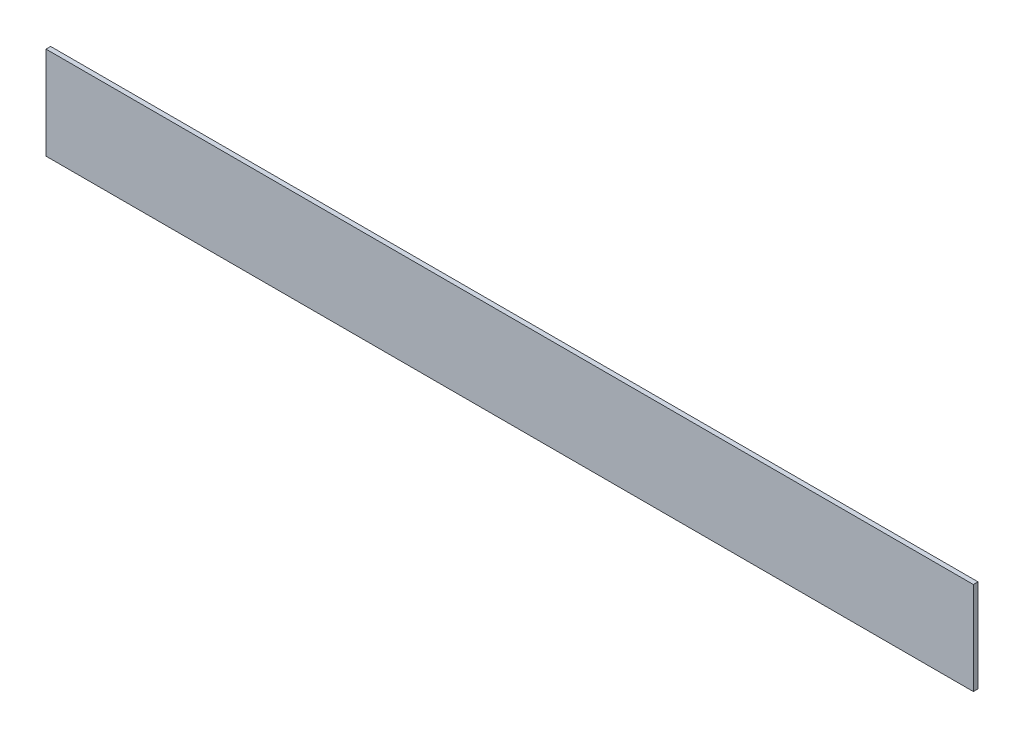
ISO-10303-21;
HEADER;
FILE_DESCRIPTION(('STEP AP214'),'2;1');
FILE_NAME('part.step','',(''),(''),'','','');
FILE_SCHEMA(('AUTOMOTIVE_DESIGN { 1 0 10303 214 1 1 1 1 }'));
ENDSEC;
DATA;
#1=APPLICATION_CONTEXT('core data for automotive mechanical design processes');
#2=APPLICATION_PROTOCOL_DEFINITION('international standard','automotive_design',2000,#1);
#3=PRODUCT_CONTEXT('',#1,'mechanical');
#4=PRODUCT('Part','Part','',(#3));
#5=PRODUCT_RELATED_PRODUCT_CATEGORY('part','',(#4));
#6=PRODUCT_DEFINITION_FORMATION('','',#4);
#7=PRODUCT_DEFINITION_CONTEXT('part definition',#1,'design');
#8=PRODUCT_DEFINITION('design','',#6,#7);
#9=PRODUCT_DEFINITION_SHAPE('','',#8);
#10=(LENGTH_UNIT() NAMED_UNIT(*) SI_UNIT(.MILLI.,.METRE.));
#11=(NAMED_UNIT(*) PLANE_ANGLE_UNIT() SI_UNIT($,.RADIAN.));
#12=(NAMED_UNIT(*) SI_UNIT($,.STERADIAN.) SOLID_ANGLE_UNIT());
#13=UNCERTAINTY_MEASURE_WITH_UNIT(LENGTH_MEASURE(1.E-05),#10,'distance_accuracy_value','');
#14=(GEOMETRIC_REPRESENTATION_CONTEXT(3) GLOBAL_UNCERTAINTY_ASSIGNED_CONTEXT((#13)) GLOBAL_UNIT_ASSIGNED_CONTEXT((#10,
#11,#12)) REPRESENTATION_CONTEXT('',''));
#15=CARTESIAN_POINT('',(0.,0.,0.));
#16=DIRECTION('',(0.,0.,1.));
#17=DIRECTION('',(1.,0.,0.));
#18=AXIS2_PLACEMENT_3D('',#15,#16,#17);
#19=CARTESIAN_POINT('',(0.,0.,-5.));
#20=DIRECTION('',(-1.,0.,0.));
#21=DIRECTION('',(0.,-1.,0.));
#22=AXIS2_PLACEMENT_3D('',#19,#20,#21);
#23=PLANE('',#22);
#24=DIRECTION('',(0.,-1.,0.));
#25=VECTOR('',#24,1.);
#26=CARTESIAN_POINT('',(0.,0.,0.));
#27=LINE('',#26,#25);
#28=CARTESIAN_POINT('',(0.,0.,0.));
#29=VERTEX_POINT('',#28);
#30=CARTESIAN_POINT('',(0.,-100.,0.));
#31=VERTEX_POINT('',#30);
#32=EDGE_CURVE('E104',#29,#31,#27,.T.);
#33=ORIENTED_EDGE('',*,*,#32,.F.);
#34=DIRECTION('',(0.,0.,1.));
#35=VECTOR('',#34,1.);
#36=CARTESIAN_POINT('',(0.,0.,-5.));
#37=LINE('',#36,#35);
#38=CARTESIAN_POINT('',(0.,0.,-5.));
#39=VERTEX_POINT('',#38);
#40=EDGE_CURVE('E11',#39,#29,#37,.T.);
#41=ORIENTED_EDGE('',*,*,#40,.F.);
#42=DIRECTION('',(0.,-1.,0.));
#43=VECTOR('',#42,1.);
#44=CARTESIAN_POINT('',(0.,0.,-5.));
#45=LINE('',#44,#43);
#46=CARTESIAN_POINT('',(0.,-100.,-5.));
#47=VERTEX_POINT('',#46);
#48=EDGE_CURVE('E98',#39,#47,#45,.T.);
#49=ORIENTED_EDGE('',*,*,#48,.T.);
#50=DIRECTION('',(0.,0.,1.));
#51=VECTOR('',#50,1.);
#52=CARTESIAN_POINT('',(0.,-100.,-5.));
#53=LINE('',#52,#51);
#54=EDGE_CURVE('E43',#47,#31,#53,.T.);
#55=ORIENTED_EDGE('',*,*,#54,.T.);
#56=EDGE_LOOP('',(#33,#41,#49,#55));
#57=FACE_BOUND('',#56,.T.);
#58=ADVANCED_FACE('F40',(#57),#23,.T.);
#59=CARTESIAN_POINT('',(0.,0.,-5.));
#60=DIRECTION('',(0.,1.,0.));
#61=DIRECTION('',(0.,0.,1.));
#62=AXIS2_PLACEMENT_3D('',#59,#60,#61);
#63=PLANE('',#62);
#64=DIRECTION('',(-1.,0.,0.));
#65=VECTOR('',#64,1.);
#66=CARTESIAN_POINT('',(0.,0.,0.));
#67=LINE('',#66,#65);
#68=CARTESIAN_POINT('',(1000.,0.,0.));
#69=VERTEX_POINT('',#68);
#70=EDGE_CURVE('E100',#69,#29,#67,.T.);
#71=ORIENTED_EDGE('',*,*,#70,.F.);
#72=DIRECTION('',(0.,0.,1.));
#73=VECTOR('',#72,1.);
#74=CARTESIAN_POINT('',(1000.,0.,-5.));
#75=LINE('',#74,#73);
#76=CARTESIAN_POINT('',(1000.,0.,-5.));
#77=VERTEX_POINT('',#76);
#78=EDGE_CURVE('E49',#77,#69,#75,.T.);
#79=ORIENTED_EDGE('',*,*,#78,.F.);
#80=DIRECTION('',(-1.,0.,0.));
#81=VECTOR('',#80,1.);
#82=CARTESIAN_POINT('',(0.,0.,-5.));
#83=LINE('',#82,#81);
#84=EDGE_CURVE('E95',#77,#39,#83,.T.);
#85=ORIENTED_EDGE('',*,*,#84,.T.);
#86=ORIENTED_EDGE('',*,*,#40,.T.);
#87=EDGE_LOOP('',(#71,#79,#85,#86));
#88=FACE_BOUND('',#87,.T.);
#89=ADVANCED_FACE('F114',(#88),#63,.T.);
#90=CARTESIAN_POINT('',(1000.,0.,-5.));
#91=DIRECTION('',(1.,0.,0.));
#92=DIRECTION('',(0.,0.,-1.));
#93=AXIS2_PLACEMENT_3D('',#90,#91,#92);
#94=PLANE('',#93);
#95=DIRECTION('',(0.,1.,0.));
#96=VECTOR('',#95,1.);
#97=CARTESIAN_POINT('',(1000.,0.,0.));
#98=LINE('',#97,#96);
#99=CARTESIAN_POINT('',(1000.,-100.,0.));
#100=VERTEX_POINT('',#99);
#101=EDGE_CURVE('E90',#100,#69,#98,.T.);
#102=ORIENTED_EDGE('',*,*,#101,.F.);
#103=DIRECTION('',(0.,0.,1.));
#104=VECTOR('',#103,1.);
#105=CARTESIAN_POINT('',(1000.,-100.,-5.));
#106=LINE('',#105,#104);
#107=CARTESIAN_POINT('',(1000.,-100.,-5.));
#108=VERTEX_POINT('',#107);
#109=EDGE_CURVE('E85',#108,#100,#106,.T.);
#110=ORIENTED_EDGE('',*,*,#109,.F.);
#111=DIRECTION('',(0.,1.,0.));
#112=VECTOR('',#111,1.);
#113=CARTESIAN_POINT('',(1000.,0.,-5.));
#114=LINE('',#113,#112);
#115=EDGE_CURVE('E88',#108,#77,#114,.T.);
#116=ORIENTED_EDGE('',*,*,#115,.T.);
#117=ORIENTED_EDGE('',*,*,#78,.T.);
#118=EDGE_LOOP('',(#102,#110,#116,#117));
#119=FACE_BOUND('',#118,.T.);
#120=ADVANCED_FACE('F87',(#119),#94,.T.);
#121=CARTESIAN_POINT('',(0.,-100.,-5.));
#122=DIRECTION('',(0.,-1.,0.));
#123=DIRECTION('',(0.,0.,-1.));
#124=AXIS2_PLACEMENT_3D('',#121,#122,#123);
#125=PLANE('',#124);
#126=DIRECTION('',(1.,0.,0.));
#127=VECTOR('',#126,1.);
#128=CARTESIAN_POINT('',(0.,-100.,0.));
#129=LINE('',#128,#127);
#130=EDGE_CURVE('E107',#31,#100,#129,.T.);
#131=ORIENTED_EDGE('',*,*,#130,.F.);
#132=ORIENTED_EDGE('',*,*,#54,.F.);
#133=DIRECTION('',(1.,0.,0.));
#134=VECTOR('',#133,1.);
#135=CARTESIAN_POINT('',(0.,-100.,-5.));
#136=LINE('',#135,#134);
#137=EDGE_CURVE('E94',#47,#108,#136,.T.);
#138=ORIENTED_EDGE('',*,*,#137,.T.);
#139=ORIENTED_EDGE('',*,*,#109,.T.);
#140=EDGE_LOOP('',(#131,#132,#138,#139));
#141=FACE_BOUND('',#140,.T.);
#142=ADVANCED_FACE('F97',(#141),#125,.T.);
#143=CARTESIAN_POINT('',(0.,0.,-5.));
#144=DIRECTION('',(0.,0.,1.));
#145=DIRECTION('',(1.,0.,0.));
#146=AXIS2_PLACEMENT_3D('',#143,#144,#145);
#147=PLANE('',#146);
#148=ORIENTED_EDGE('',*,*,#48,.F.);
#149=ORIENTED_EDGE('',*,*,#84,.F.);
#150=ORIENTED_EDGE('',*,*,#115,.F.);
#151=ORIENTED_EDGE('',*,*,#137,.F.);
#152=EDGE_LOOP('',(#148,#149,#150,#151));
#153=FACE_BOUND('',#152,.T.);
#154=ADVANCED_FACE('F93',(#153),#147,.F.);
#155=CARTESIAN_POINT('',(0.,0.,0.));
#156=DIRECTION('',(0.,0.,1.));
#157=DIRECTION('',(1.,0.,0.));
#158=AXIS2_PLACEMENT_3D('',#155,#156,#157);
#159=PLANE('',#158);
#160=ORIENTED_EDGE('',*,*,#32,.T.);
#161=ORIENTED_EDGE('',*,*,#130,.T.);
#162=ORIENTED_EDGE('',*,*,#101,.T.);
#163=ORIENTED_EDGE('',*,*,#70,.T.);
#164=EDGE_LOOP('',(#160,#161,#162,#163));
#165=FACE_BOUND('',#164,.T.);
#166=ADVANCED_FACE('F113',(#165),#159,.T.);
#167=CLOSED_SHELL('',(#58,#89,#120,#142,#154,#166));
#168=MANIFOLD_SOLID_BREP('B2',#167);
#169=ADVANCED_BREP_SHAPE_REPRESENTATION('',(#18,#168),#14);
#170=SHAPE_DEFINITION_REPRESENTATION(#9,#169);
ENDSEC;
END-ISO-10303-21;
